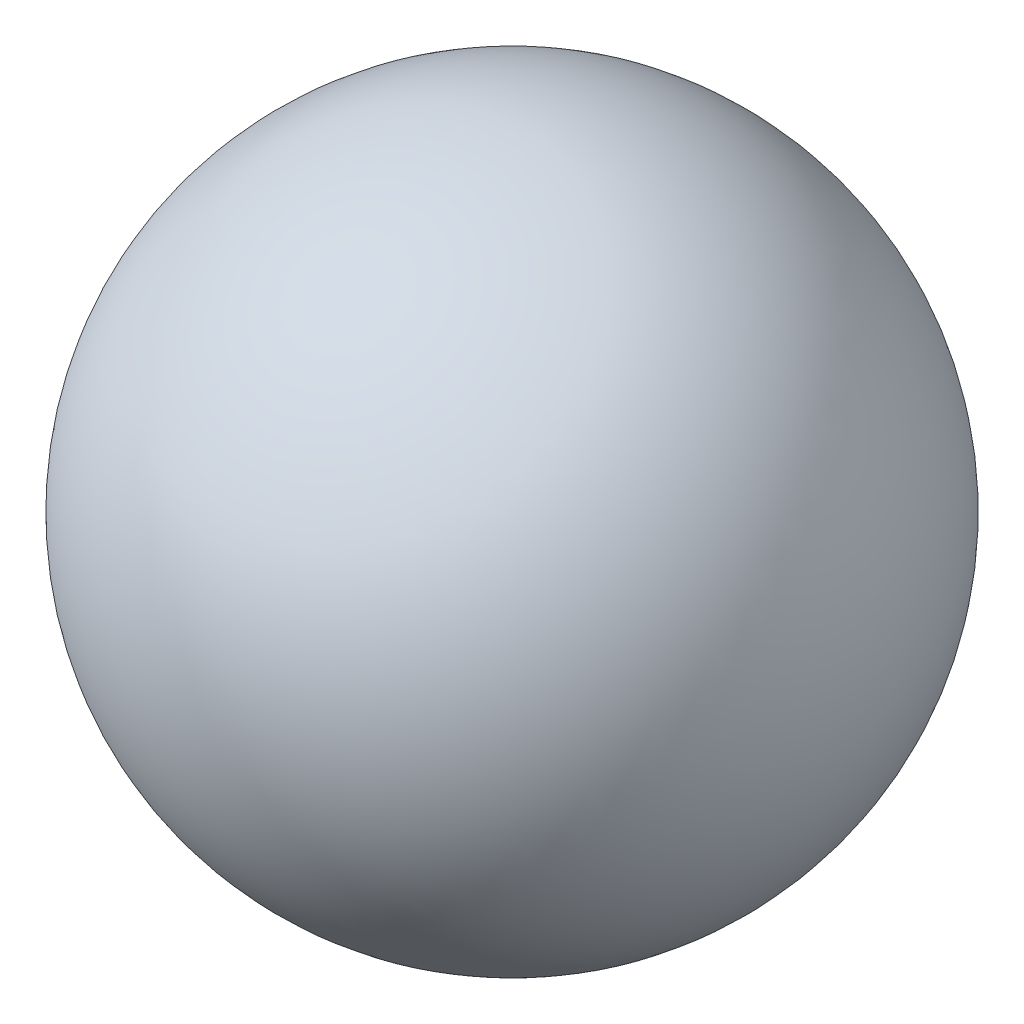
ISO-10303-21;
HEADER;
FILE_DESCRIPTION(('STEP AP214'),'2;1');
FILE_NAME('part.step','',(''),(''),'','','');
FILE_SCHEMA(('AUTOMOTIVE_DESIGN { 1 0 10303 214 1 1 1 1 }'));
ENDSEC;
DATA;
#1=APPLICATION_CONTEXT('core data for automotive mechanical design processes');
#2=APPLICATION_PROTOCOL_DEFINITION('international standard','automotive_design',2000,#1);
#3=PRODUCT_CONTEXT('',#1,'mechanical');
#4=PRODUCT('Part','Part','',(#3));
#5=PRODUCT_RELATED_PRODUCT_CATEGORY('part','',(#4));
#6=PRODUCT_DEFINITION_FORMATION('','',#4);
#7=PRODUCT_DEFINITION_CONTEXT('part definition',#1,'design');
#8=PRODUCT_DEFINITION('design','',#6,#7);
#9=PRODUCT_DEFINITION_SHAPE('','',#8);
#10=(LENGTH_UNIT() NAMED_UNIT(*) SI_UNIT(.MILLI.,.METRE.));
#11=(NAMED_UNIT(*) PLANE_ANGLE_UNIT() SI_UNIT($,.RADIAN.));
#12=(NAMED_UNIT(*) SI_UNIT($,.STERADIAN.) SOLID_ANGLE_UNIT());
#13=UNCERTAINTY_MEASURE_WITH_UNIT(LENGTH_MEASURE(1.E-05),#10,'distance_accuracy_value','');
#14=(GEOMETRIC_REPRESENTATION_CONTEXT(3) GLOBAL_UNCERTAINTY_ASSIGNED_CONTEXT((#13)) GLOBAL_UNIT_ASSIGNED_CONTEXT((#10,
#11,#12)) REPRESENTATION_CONTEXT('',''));
#15=CARTESIAN_POINT('',(0.,0.,0.));
#16=DIRECTION('',(0.,0.,1.));
#17=DIRECTION('',(1.,0.,0.));
#18=AXIS2_PLACEMENT_3D('',#15,#16,#17);
#19=CARTESIAN_POINT('',(0.,0.,0.));
#20=DIRECTION('',(0.,1.,0.));
#21=DIRECTION('',(1.,0.,0.));
#22=AXIS2_PLACEMENT_3D('',#19,#20,#21);
#23=SPHERICAL_SURFACE('',#22,410.616562417);
#24=CARTESIAN_POINT('',(0.,410.616562417,0.));
#25=VERTEX_POINT('',#24);
#26=VERTEX_LOOP('',#25);
#27=FACE_BOUND('',#26,.T.);
#28=ADVANCED_FACE('F33',(#27),#23,.T.);
#29=CLOSED_SHELL('',(#28));
#30=MANIFOLD_SOLID_BREP('B2',#29);
#31=ADVANCED_BREP_SHAPE_REPRESENTATION('',(#18,#30),#14);
#32=SHAPE_DEFINITION_REPRESENTATION(#9,#31);
ENDSEC;
END-ISO-10303-21;
